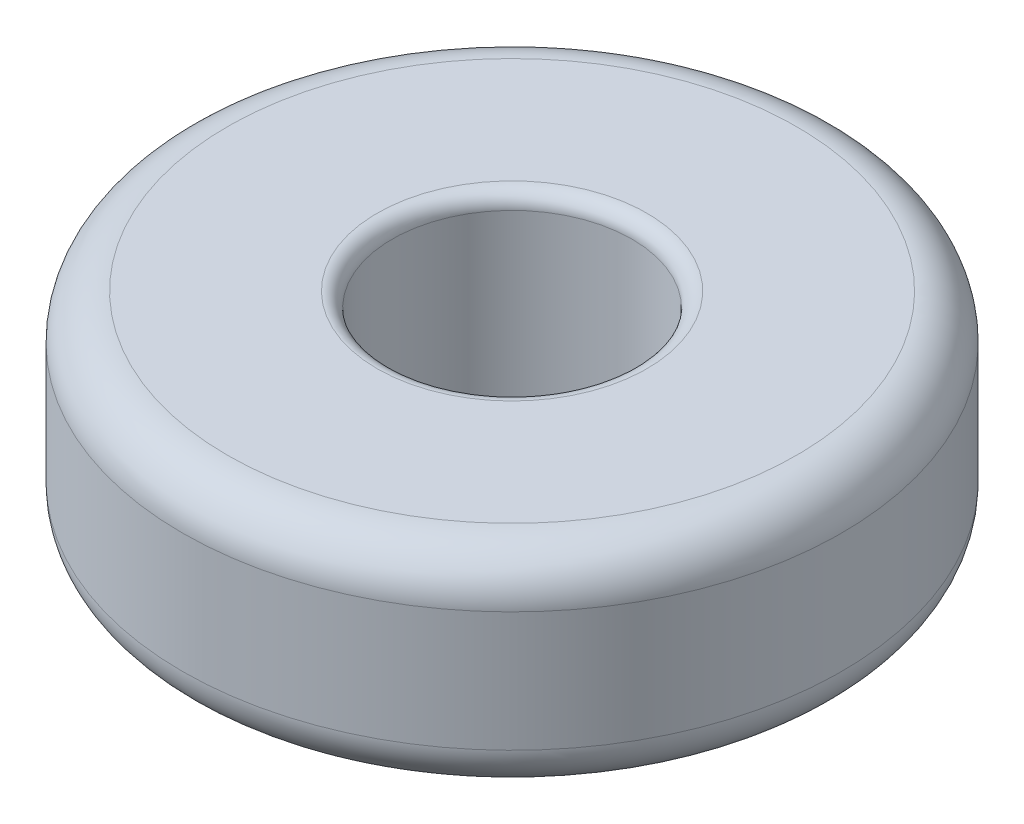
ISO-10303-21;
HEADER;
FILE_DESCRIPTION(('STEP AP214'),'2;1');
FILE_NAME('part.step','',(''),(''),'','','');
FILE_SCHEMA(('AUTOMOTIVE_DESIGN { 1 0 10303 214 1 1 1 1 }'));
ENDSEC;
DATA;
#1=APPLICATION_CONTEXT('core data for automotive mechanical design processes');
#2=APPLICATION_PROTOCOL_DEFINITION('international standard','automotive_design',2000,#1);
#3=PRODUCT_CONTEXT('',#1,'mechanical');
#4=PRODUCT('Part','Part','',(#3));
#5=PRODUCT_RELATED_PRODUCT_CATEGORY('part','',(#4));
#6=PRODUCT_DEFINITION_FORMATION('','',#4);
#7=PRODUCT_DEFINITION_CONTEXT('part definition',#1,'design');
#8=PRODUCT_DEFINITION('design','',#6,#7);
#9=PRODUCT_DEFINITION_SHAPE('','',#8);
#10=(LENGTH_UNIT() NAMED_UNIT(*) SI_UNIT(.MILLI.,.METRE.));
#11=(NAMED_UNIT(*) PLANE_ANGLE_UNIT() SI_UNIT($,.RADIAN.));
#12=(NAMED_UNIT(*) SI_UNIT($,.STERADIAN.) SOLID_ANGLE_UNIT());
#13=UNCERTAINTY_MEASURE_WITH_UNIT(LENGTH_MEASURE(1.E-05),#10,'distance_accuracy_value','');
#14=(GEOMETRIC_REPRESENTATION_CONTEXT(3) GLOBAL_UNCERTAINTY_ASSIGNED_CONTEXT((#13)) GLOBAL_UNIT_ASSIGNED_CONTEXT((#10,
#11,#12)) REPRESENTATION_CONTEXT('',''));
#15=CARTESIAN_POINT('',(0.,0.,0.));
#16=DIRECTION('',(0.,0.,1.));
#17=DIRECTION('',(1.,0.,0.));
#18=AXIS2_PLACEMENT_3D('',#15,#16,#17);
#19=CARTESIAN_POINT('',(0.,3.5,0.));
#20=DIRECTION('',(0.,1.,0.));
#21=DIRECTION('',(0.,0.,1.));
#22=AXIS2_PLACEMENT_3D('',#19,#20,#21);
#23=PLANE('',#22);
#24=CARTESIAN_POINT('',(0.,3.5,0.));
#25=DIRECTION('',(0.,1.,0.));
#26=DIRECTION('',(0.,0.,1.));
#27=AXIS2_PLACEMENT_3D('',#24,#25,#26);
#28=CIRCLE('',#27,4.5);
#29=CARTESIAN_POINT('',(0.,3.5,4.5));
#30=VERTEX_POINT('',#29);
#31=EDGE_CURVE('E10',#30,#30,#28,.F.);
#32=ORIENTED_EDGE('',*,*,#31,.T.);
#33=EDGE_LOOP('',(#32));
#34=FACE_BOUND('',#33,.T.);
#35=CARTESIAN_POINT('',(0.,3.5,0.));
#36=DIRECTION('',(0.,1.,0.));
#37=DIRECTION('',(0.,0.,1.));
#38=AXIS2_PLACEMENT_3D('',#35,#36,#37);
#39=CIRCLE('',#38,9.5);
#40=CARTESIAN_POINT('',(0.,3.5,9.5));
#41=VERTEX_POINT('',#40);
#42=EDGE_CURVE('E50',#41,#41,#39,.T.);
#43=ORIENTED_EDGE('',*,*,#42,.T.);
#44=EDGE_LOOP('',(#43));
#45=FACE_BOUND('',#44,.T.);
#46=ADVANCED_FACE('F30',(#34,#45),#23,.T.);
#47=CARTESIAN_POINT('',(0.,-3.5,0.));
#48=DIRECTION('',(0.,1.,0.));
#49=DIRECTION('',(0.,0.,1.));
#50=AXIS2_PLACEMENT_3D('',#47,#48,#49);
#51=PLANE('',#50);
#52=CARTESIAN_POINT('',(0.,-3.5,0.));
#53=DIRECTION('',(0.,1.,0.));
#54=DIRECTION('',(0.,0.,1.));
#55=AXIS2_PLACEMENT_3D('',#52,#53,#54);
#56=CIRCLE('',#55,4.5);
#57=CARTESIAN_POINT('',(0.,-3.5,4.5));
#58=VERTEX_POINT('',#57);
#59=EDGE_CURVE('E45',#58,#58,#56,.T.);
#60=ORIENTED_EDGE('',*,*,#59,.T.);
#61=EDGE_LOOP('',(#60));
#62=FACE_BOUND('',#61,.T.);
#63=CARTESIAN_POINT('',(0.,-3.5,0.));
#64=DIRECTION('',(0.,1.,0.));
#65=DIRECTION('',(0.,0.,1.));
#66=AXIS2_PLACEMENT_3D('',#63,#64,#65);
#67=CIRCLE('',#66,9.5);
#68=CARTESIAN_POINT('',(0.,-3.5,9.5));
#69=VERTEX_POINT('',#68);
#70=EDGE_CURVE('E53',#69,#69,#67,.F.);
#71=ORIENTED_EDGE('',*,*,#70,.T.);
#72=EDGE_LOOP('',(#71));
#73=FACE_BOUND('',#72,.T.);
#74=ADVANCED_FACE('F74',(#62,#73),#51,.F.);
#75=CARTESIAN_POINT('',(0.,3.5,0.));
#76=DIRECTION('',(0.,-1.,0.));
#77=DIRECTION('',(0.,0.,-1.));
#78=AXIS2_PLACEMENT_3D('',#75,#76,#77);
#79=CYLINDRICAL_SURFACE('',#78,11.);
#80=CARTESIAN_POINT('',(0.,-2.,0.));
#81=DIRECTION('',(0.,1.,0.));
#82=DIRECTION('',(0.,0.,1.));
#83=AXIS2_PLACEMENT_3D('',#80,#81,#82);
#84=CIRCLE('',#83,11.);
#85=CARTESIAN_POINT('',(0.,-2.,11.));
#86=VERTEX_POINT('',#85);
#87=EDGE_CURVE('E56',#86,#86,#84,.T.);
#88=ORIENTED_EDGE('',*,*,#87,.T.);
#89=EDGE_LOOP('',(#88));
#90=FACE_BOUND('',#89,.T.);
#91=CARTESIAN_POINT('',(0.,2.,0.));
#92=DIRECTION('',(0.,1.,0.));
#93=DIRECTION('',(0.,0.,1.));
#94=AXIS2_PLACEMENT_3D('',#91,#92,#93);
#95=CIRCLE('',#94,11.);
#96=CARTESIAN_POINT('',(0.,2.,11.));
#97=VERTEX_POINT('',#96);
#98=EDGE_CURVE('E59',#97,#97,#95,.F.);
#99=ORIENTED_EDGE('',*,*,#98,.T.);
#100=EDGE_LOOP('',(#99));
#101=FACE_BOUND('',#100,.T.);
#102=ADVANCED_FACE('F63',(#90,#101),#79,.T.);
#103=CARTESIAN_POINT('',(0.,3.5,0.));
#104=DIRECTION('',(0.,-1.,0.));
#105=DIRECTION('',(0.,0.,-1.));
#106=AXIS2_PLACEMENT_3D('',#103,#104,#105);
#107=CYLINDRICAL_SURFACE('',#106,4.);
#108=CARTESIAN_POINT('',(0.,-3.,0.));
#109=DIRECTION('',(0.,1.,0.));
#110=DIRECTION('',(0.,0.,1.));
#111=AXIS2_PLACEMENT_3D('',#108,#109,#110);
#112=CIRCLE('',#111,4.);
#113=CARTESIAN_POINT('',(0.,-3.,4.));
#114=VERTEX_POINT('',#113);
#115=EDGE_CURVE('E37',#114,#114,#112,.F.);
#116=ORIENTED_EDGE('',*,*,#115,.T.);
#117=EDGE_LOOP('',(#116));
#118=FACE_BOUND('',#117,.T.);
#119=CARTESIAN_POINT('',(0.,3.,0.));
#120=DIRECTION('',(0.,1.,0.));
#121=DIRECTION('',(0.,0.,1.));
#122=AXIS2_PLACEMENT_3D('',#119,#120,#121);
#123=CIRCLE('',#122,4.);
#124=CARTESIAN_POINT('',(0.,3.,4.));
#125=VERTEX_POINT('',#124);
#126=EDGE_CURVE('E41',#125,#125,#123,.T.);
#127=ORIENTED_EDGE('',*,*,#126,.T.);
#128=EDGE_LOOP('',(#127));
#129=FACE_BOUND('',#128,.T.);
#130=ADVANCED_FACE('F82',(#118,#129),#107,.F.);
#131=CARTESIAN_POINT('',(0.,-2.,0.));
#132=DIRECTION('',(0.,1.,0.));
#133=DIRECTION('',(0.,0.,1.));
#134=AXIS2_PLACEMENT_3D('',#131,#132,#133);
#135=TOROIDAL_SURFACE('',#134,9.5,1.5);
#136=ORIENTED_EDGE('',*,*,#70,.F.);
#137=EDGE_LOOP('',(#136));
#138=FACE_BOUND('',#137,.T.);
#139=ORIENTED_EDGE('',*,*,#87,.F.);
#140=EDGE_LOOP('',(#139));
#141=FACE_BOUND('',#140,.T.);
#142=ADVANCED_FACE('F69',(#138,#141),#135,.T.);
#143=CARTESIAN_POINT('',(0.,2.,0.));
#144=DIRECTION('',(0.,1.,0.));
#145=DIRECTION('',(0.,0.,1.));
#146=AXIS2_PLACEMENT_3D('',#143,#144,#145);
#147=TOROIDAL_SURFACE('',#146,9.5,1.5);
#148=ORIENTED_EDGE('',*,*,#98,.F.);
#149=EDGE_LOOP('',(#148));
#150=FACE_BOUND('',#149,.T.);
#151=ORIENTED_EDGE('',*,*,#42,.F.);
#152=EDGE_LOOP('',(#151));
#153=FACE_BOUND('',#152,.T.);
#154=ADVANCED_FACE('F65',(#150,#153),#147,.T.);
#155=CARTESIAN_POINT('',(0.,-3.,0.));
#156=DIRECTION('',(0.,1.,0.));
#157=DIRECTION('',(0.,0.,1.));
#158=AXIS2_PLACEMENT_3D('',#155,#156,#157);
#159=TOROIDAL_SURFACE('',#158,4.5,0.5);
#160=ORIENTED_EDGE('',*,*,#115,.F.);
#161=EDGE_LOOP('',(#160));
#162=FACE_BOUND('',#161,.T.);
#163=ORIENTED_EDGE('',*,*,#59,.F.);
#164=EDGE_LOOP('',(#163));
#165=FACE_BOUND('',#164,.T.);
#166=ADVANCED_FACE('F68',(#162,#165),#159,.T.);
#167=CARTESIAN_POINT('',(0.,3.,0.));
#168=DIRECTION('',(0.,1.,0.));
#169=DIRECTION('',(0.,0.,1.));
#170=AXIS2_PLACEMENT_3D('',#167,#168,#169);
#171=TOROIDAL_SURFACE('',#170,4.5,0.5);
#172=ORIENTED_EDGE('',*,*,#31,.F.);
#173=EDGE_LOOP('',(#172));
#174=FACE_BOUND('',#173,.T.);
#175=ORIENTED_EDGE('',*,*,#126,.F.);
#176=EDGE_LOOP('',(#175));
#177=FACE_BOUND('',#176,.T.);
#178=ADVANCED_FACE('F32',(#174,#177),#171,.T.);
#179=CLOSED_SHELL('',(#46,#74,#102,#130,#142,#154,#166,#178));
#180=MANIFOLD_SOLID_BREP('B2',#179);
#181=ADVANCED_BREP_SHAPE_REPRESENTATION('',(#18,#180),#14);
#182=SHAPE_DEFINITION_REPRESENTATION(#9,#181);
ENDSEC;
END-ISO-10303-21;
